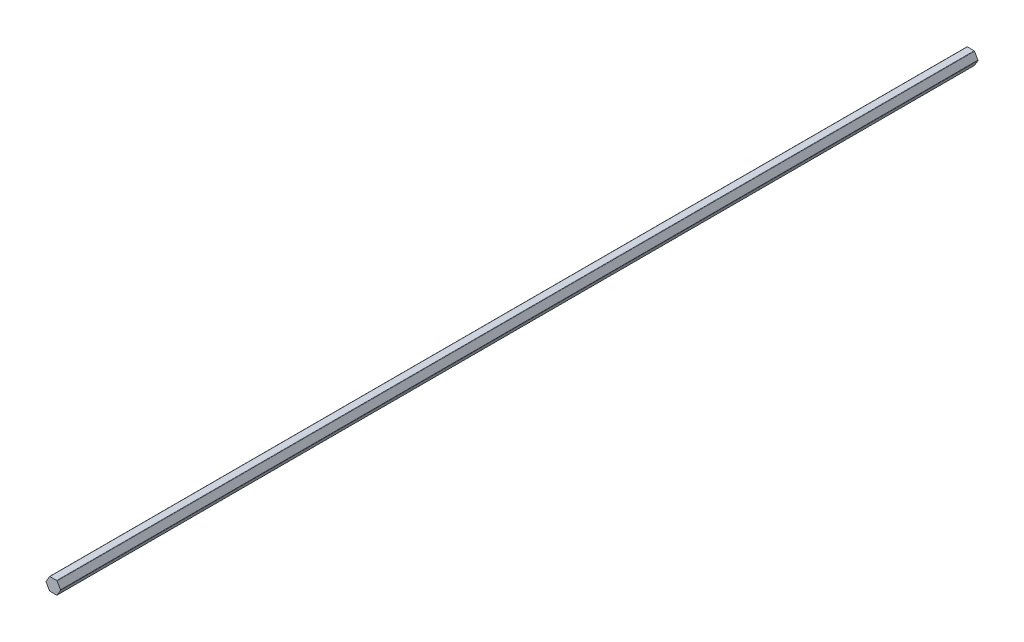
ISO-10303-21;
HEADER;
FILE_DESCRIPTION(('STEP AP214'),'2;1');
FILE_NAME('part.step','',(''),(''),'','','');
FILE_SCHEMA(('AUTOMOTIVE_DESIGN { 1 0 10303 214 1 1 1 1 }'));
ENDSEC;
DATA;
#1=APPLICATION_CONTEXT('core data for automotive mechanical design processes');
#2=APPLICATION_PROTOCOL_DEFINITION('international standard','automotive_design',2000,#1);
#3=PRODUCT_CONTEXT('',#1,'mechanical');
#4=PRODUCT('Part','Part','',(#3));
#5=PRODUCT_RELATED_PRODUCT_CATEGORY('part','',(#4));
#6=PRODUCT_DEFINITION_FORMATION('','',#4);
#7=PRODUCT_DEFINITION_CONTEXT('part definition',#1,'design');
#8=PRODUCT_DEFINITION('design','',#6,#7);
#9=PRODUCT_DEFINITION_SHAPE('','',#8);
#10=(LENGTH_UNIT() NAMED_UNIT(*) SI_UNIT(.MILLI.,.METRE.));
#11=(NAMED_UNIT(*) PLANE_ANGLE_UNIT() SI_UNIT($,.RADIAN.));
#12=(NAMED_UNIT(*) SI_UNIT($,.STERADIAN.) SOLID_ANGLE_UNIT());
#13=UNCERTAINTY_MEASURE_WITH_UNIT(LENGTH_MEASURE(1.E-05),#10,'distance_accuracy_value','');
#14=(GEOMETRIC_REPRESENTATION_CONTEXT(3) GLOBAL_UNCERTAINTY_ASSIGNED_CONTEXT((#13)) GLOBAL_UNIT_ASSIGNED_CONTEXT((#10,
#11,#12)) REPRESENTATION_CONTEXT('',''));
#15=CARTESIAN_POINT('',(0.,0.,0.));
#16=DIRECTION('',(0.,0.,1.));
#17=DIRECTION('',(1.,0.,0.));
#18=AXIS2_PLACEMENT_3D('',#15,#16,#17);
#19=CARTESIAN_POINT('',(3.66617420935413,-6.35,457.2));
#20=DIRECTION('',(-0.866025403784439,0.499999999999999,0.));
#21=DIRECTION('',(-0.499999999999999,-0.866025403784439,0.));
#22=AXIS2_PLACEMENT_3D('',#19,#20,#21);
#23=PLANE('',#22);
#24=DIRECTION('',(0.499999999999999,0.866025403784439,0.));
#25=VECTOR('',#24,1.);
#26=CARTESIAN_POINT('',(3.66617420935413,-6.35,457.2));
#27=LINE('',#26,#25);
#28=CARTESIAN_POINT('',(3.81282117772829,-6.096,457.2));
#29=VERTEX_POINT('',#28);
#30=CARTESIAN_POINT('',(7.18570145033408,-0.253999999999996,457.2));
#31=VERTEX_POINT('',#30);
#32=EDGE_CURVE('E151',#29,#31,#27,.T.);
#33=ORIENTED_EDGE('',*,*,#32,.F.);
#34=DIRECTION('',(0.,0.,-1.));
#35=VECTOR('',#34,1.);
#36=CARTESIAN_POINT('',(3.81282117772829,-6.096,457.2));
#37=LINE('',#36,#35);
#38=CARTESIAN_POINT('',(3.81282117772829,-6.096,-457.2));
#39=VERTEX_POINT('',#38);
#40=EDGE_CURVE('E189',#29,#39,#37,.T.);
#41=ORIENTED_EDGE('',*,*,#40,.T.);
#42=DIRECTION('',(0.499999999999999,0.866025403784439,0.));
#43=VECTOR('',#42,1.);
#44=CARTESIAN_POINT('',(3.66617420935413,-6.35,-457.2));
#45=LINE('',#44,#43);
#46=CARTESIAN_POINT('',(7.18570145033408,-0.253999999999996,-457.2));
#47=VERTEX_POINT('',#46);
#48=EDGE_CURVE('E213',#39,#47,#45,.T.);
#49=ORIENTED_EDGE('',*,*,#48,.T.);
#50=DIRECTION('',(0.,0.,-1.));
#51=VECTOR('',#50,1.);
#52=CARTESIAN_POINT('',(7.18570145033408,-0.253999999999996,457.2));
#53=LINE('',#52,#51);
#54=EDGE_CURVE('E187',#47,#31,#53,.F.);
#55=ORIENTED_EDGE('',*,*,#54,.T.);
#56=EDGE_LOOP('',(#33,#41,#49,#55));
#57=FACE_BOUND('',#56,.T.);
#58=ADVANCED_FACE('F34',(#57),#23,.F.);
#59=CARTESIAN_POINT('',(7.33234841870825,0.,457.2));
#60=DIRECTION('',(-0.866025403784439,-0.5,0.));
#61=DIRECTION('',(0.5,-0.866025403784438,0.));
#62=AXIS2_PLACEMENT_3D('',#59,#60,#61);
#63=PLANE('',#62);
#64=DIRECTION('',(-0.5,0.866025403784438,0.));
#65=VECTOR('',#64,1.);
#66=CARTESIAN_POINT('',(7.33234841870825,0.,457.2));
#67=LINE('',#66,#65);
#68=CARTESIAN_POINT('',(7.18570145033408,0.254000000000004,457.2));
#69=VERTEX_POINT('',#68);
#70=CARTESIAN_POINT('',(3.81282117772829,6.096,457.2));
#71=VERTEX_POINT('',#70);
#72=EDGE_CURVE('E155',#69,#71,#67,.T.);
#73=ORIENTED_EDGE('',*,*,#72,.F.);
#74=DIRECTION('',(0.,0.,-1.));
#75=VECTOR('',#74,1.);
#76=CARTESIAN_POINT('',(7.18570145033408,0.254000000000004,457.2));
#77=LINE('',#76,#75);
#78=CARTESIAN_POINT('',(7.18570145033408,0.254000000000004,-457.2));
#79=VERTEX_POINT('',#78);
#80=EDGE_CURVE('E194',#69,#79,#77,.T.);
#81=ORIENTED_EDGE('',*,*,#80,.T.);
#82=DIRECTION('',(-0.5,0.866025403784438,0.));
#83=VECTOR('',#82,1.);
#84=CARTESIAN_POINT('',(7.33234841870825,0.,-457.2));
#85=LINE('',#84,#83);
#86=CARTESIAN_POINT('',(3.81282117772829,6.096,-457.2));
#87=VERTEX_POINT('',#86);
#88=EDGE_CURVE('E211',#79,#87,#85,.T.);
#89=ORIENTED_EDGE('',*,*,#88,.T.);
#90=DIRECTION('',(0.,0.,-1.));
#91=VECTOR('',#90,1.);
#92=CARTESIAN_POINT('',(3.81282117772829,6.096,457.2));
#93=LINE('',#92,#91);
#94=EDGE_CURVE('E192',#87,#71,#93,.F.);
#95=ORIENTED_EDGE('',*,*,#94,.T.);
#96=EDGE_LOOP('',(#73,#81,#89,#95));
#97=FACE_BOUND('',#96,.T.);
#98=ADVANCED_FACE('F232',(#97),#63,.F.);
#99=CARTESIAN_POINT('',(3.66617420935412,6.35,457.2));
#100=DIRECTION('',(0.,-1.,0.));
#101=DIRECTION('',(1.,0.,0.));
#102=AXIS2_PLACEMENT_3D('',#99,#100,#101);
#103=PLANE('',#102);
#104=DIRECTION('',(-1.,0.,0.));
#105=VECTOR('',#104,1.);
#106=CARTESIAN_POINT('',(3.66617420935412,6.35,-457.2));
#107=LINE('',#106,#105);
#108=CARTESIAN_POINT('',(3.37288027260579,6.35,-457.2));
#109=VERTEX_POINT('',#108);
#110=CARTESIAN_POINT('',(-3.3728802726058,6.35,-457.2));
#111=VERTEX_POINT('',#110);
#112=EDGE_CURVE('E203',#109,#111,#107,.T.);
#113=ORIENTED_EDGE('',*,*,#112,.T.);
#114=DIRECTION('',(0.,0.,-1.));
#115=VECTOR('',#114,1.);
#116=CARTESIAN_POINT('',(-3.3728802726058,6.35,457.2));
#117=LINE('',#116,#115);
#118=CARTESIAN_POINT('',(-3.3728802726058,6.35,457.2));
#119=VERTEX_POINT('',#118);
#120=EDGE_CURVE('E11',#111,#119,#117,.F.);
#121=ORIENTED_EDGE('',*,*,#120,.T.);
#122=DIRECTION('',(-1.,0.,0.));
#123=VECTOR('',#122,1.);
#124=CARTESIAN_POINT('',(3.66617420935412,6.35,457.2));
#125=LINE('',#124,#123);
#126=CARTESIAN_POINT('',(3.37288027260579,6.35,457.2));
#127=VERTEX_POINT('',#126);
#128=EDGE_CURVE('E205',#127,#119,#125,.T.);
#129=ORIENTED_EDGE('',*,*,#128,.F.);
#130=DIRECTION('',(0.,0.,-1.));
#131=VECTOR('',#130,1.);
#132=CARTESIAN_POINT('',(3.37288027260579,6.35,457.2));
#133=LINE('',#132,#131);
#134=EDGE_CURVE('E42',#127,#109,#133,.T.);
#135=ORIENTED_EDGE('',*,*,#134,.T.);
#136=EDGE_LOOP('',(#113,#121,#129,#135));
#137=FACE_BOUND('',#136,.T.);
#138=ADVANCED_FACE('F202',(#137),#103,.F.);
#139=CARTESIAN_POINT('',(-3.66617420935412,6.35,457.2));
#140=DIRECTION('',(0.866025403784439,-0.499999999999999,0.));
#141=DIRECTION('',(0.5,0.866025403784439,0.));
#142=AXIS2_PLACEMENT_3D('',#139,#140,#141);
#143=PLANE('',#142);
#144=DIRECTION('',(-0.5,-0.866025403784439,0.));
#145=VECTOR('',#144,1.);
#146=CARTESIAN_POINT('',(-3.66617420935412,6.35,-457.2));
#147=LINE('',#146,#145);
#148=CARTESIAN_POINT('',(-3.81282117772829,6.096,-457.2));
#149=VERTEX_POINT('',#148);
#150=CARTESIAN_POINT('',(-7.18570145033408,0.253999999999998,-457.2));
#151=VERTEX_POINT('',#150);
#152=EDGE_CURVE('E157',#149,#151,#147,.T.);
#153=ORIENTED_EDGE('',*,*,#152,.T.);
#154=DIRECTION('',(0.,0.,-1.));
#155=VECTOR('',#154,1.);
#156=CARTESIAN_POINT('',(-7.18570145033408,0.253999999999998,457.2));
#157=LINE('',#156,#155);
#158=CARTESIAN_POINT('',(-7.18570145033408,0.253999999999998,457.2));
#159=VERTEX_POINT('',#158);
#160=EDGE_CURVE('E49',#151,#159,#157,.F.);
#161=ORIENTED_EDGE('',*,*,#160,.T.);
#162=DIRECTION('',(-0.5,-0.866025403784439,0.));
#163=VECTOR('',#162,1.);
#164=CARTESIAN_POINT('',(-3.66617420935412,6.35,457.2));
#165=LINE('',#164,#163);
#166=CARTESIAN_POINT('',(-3.81282117772829,6.096,457.2));
#167=VERTEX_POINT('',#166);
#168=EDGE_CURVE('E222',#167,#159,#165,.T.);
#169=ORIENTED_EDGE('',*,*,#168,.F.);
#170=DIRECTION('',(0.,0.,-1.));
#171=VECTOR('',#170,1.);
#172=CARTESIAN_POINT('',(-3.81282117772829,6.096,457.2));
#173=LINE('',#172,#171);
#174=EDGE_CURVE('E183',#167,#149,#173,.T.);
#175=ORIENTED_EDGE('',*,*,#174,.T.);
#176=EDGE_LOOP('',(#153,#161,#169,#175));
#177=FACE_BOUND('',#176,.T.);
#178=ADVANCED_FACE('F270',(#177),#143,.F.);
#179=CARTESIAN_POINT('',(-7.33234841870824,0.,457.2));
#180=DIRECTION('',(0.866025403784438,0.5,0.));
#181=DIRECTION('',(-0.5,0.866025403784439,0.));
#182=AXIS2_PLACEMENT_3D('',#179,#180,#181);
#183=PLANE('',#182);
#184=DIRECTION('',(0.5,-0.866025403784438,0.));
#185=VECTOR('',#184,1.);
#186=CARTESIAN_POINT('',(-7.33234841870824,0.,-457.2));
#187=LINE('',#186,#185);
#188=CARTESIAN_POINT('',(-7.18570145033408,-0.254000000000001,-457.2));
#189=VERTEX_POINT('',#188);
#190=CARTESIAN_POINT('',(-3.81282117772828,-6.096,-457.2));
#191=VERTEX_POINT('',#190);
#192=EDGE_CURVE('E152',#189,#191,#187,.T.);
#193=ORIENTED_EDGE('',*,*,#192,.T.);
#194=DIRECTION('',(0.,0.,-1.));
#195=VECTOR('',#194,1.);
#196=CARTESIAN_POINT('',(-3.81282117772828,-6.096,457.2));
#197=LINE('',#196,#195);
#198=CARTESIAN_POINT('',(-3.81282117772828,-6.096,457.2));
#199=VERTEX_POINT('',#198);
#200=EDGE_CURVE('E129',#191,#199,#197,.F.);
#201=ORIENTED_EDGE('',*,*,#200,.T.);
#202=DIRECTION('',(0.5,-0.866025403784438,0.));
#203=VECTOR('',#202,1.);
#204=CARTESIAN_POINT('',(-7.33234841870824,0.,457.2));
#205=LINE('',#204,#203);
#206=CARTESIAN_POINT('',(-7.18570145033408,-0.254000000000001,457.2));
#207=VERTEX_POINT('',#206);
#208=EDGE_CURVE('E219',#207,#199,#205,.T.);
#209=ORIENTED_EDGE('',*,*,#208,.F.);
#210=DIRECTION('',(0.,0.,-1.));
#211=VECTOR('',#210,1.);
#212=CARTESIAN_POINT('',(-7.18570145033408,-0.254000000000001,457.2));
#213=LINE('',#212,#211);
#214=EDGE_CURVE('E134',#207,#189,#213,.T.);
#215=ORIENTED_EDGE('',*,*,#214,.T.);
#216=EDGE_LOOP('',(#193,#201,#209,#215));
#217=FACE_BOUND('',#216,.T.);
#218=ADVANCED_FACE('F269',(#217),#183,.F.);
#219=CARTESIAN_POINT('',(-3.66617420935412,-6.35,457.2));
#220=DIRECTION('',(0.,1.,0.));
#221=DIRECTION('',(-1.,0.,0.));
#222=AXIS2_PLACEMENT_3D('',#219,#220,#221);
#223=PLANE('',#222);
#224=DIRECTION('',(1.,0.,0.));
#225=VECTOR('',#224,1.);
#226=CARTESIAN_POINT('',(-3.66617420935412,-6.35,457.2));
#227=LINE('',#226,#225);
#228=CARTESIAN_POINT('',(-3.37288027260579,-6.35,457.2));
#229=VERTEX_POINT('',#228);
#230=CARTESIAN_POINT('',(3.3728802726058,-6.35,457.2));
#231=VERTEX_POINT('',#230);
#232=EDGE_CURVE('E144',#229,#231,#227,.T.);
#233=ORIENTED_EDGE('',*,*,#232,.F.);
#234=DIRECTION('',(0.,0.,-1.));
#235=VECTOR('',#234,1.);
#236=CARTESIAN_POINT('',(-3.37288027260579,-6.35,457.2));
#237=LINE('',#236,#235);
#238=CARTESIAN_POINT('',(-3.37288027260579,-6.35,-457.2));
#239=VERTEX_POINT('',#238);
#240=EDGE_CURVE('E128',#229,#239,#237,.T.);
#241=ORIENTED_EDGE('',*,*,#240,.T.);
#242=DIRECTION('',(1.,0.,0.));
#243=VECTOR('',#242,1.);
#244=CARTESIAN_POINT('',(-3.66617420935412,-6.35,-457.2));
#245=LINE('',#244,#243);
#246=CARTESIAN_POINT('',(3.3728802726058,-6.35,-457.2));
#247=VERTEX_POINT('',#246);
#248=EDGE_CURVE('E141',#239,#247,#245,.T.);
#249=ORIENTED_EDGE('',*,*,#248,.T.);
#250=DIRECTION('',(0.,0.,-1.));
#251=VECTOR('',#250,1.);
#252=CARTESIAN_POINT('',(3.3728802726058,-6.35,457.2));
#253=LINE('',#252,#251);
#254=EDGE_CURVE('E146',#247,#231,#253,.F.);
#255=ORIENTED_EDGE('',*,*,#254,.T.);
#256=EDGE_LOOP('',(#233,#241,#249,#255));
#257=FACE_BOUND('',#256,.T.);
#258=ADVANCED_FACE('F140',(#257),#223,.F.);
#259=CARTESIAN_POINT('',(7.33234841870825,0.,457.2));
#260=DIRECTION('',(0.,0.,1.));
#261=DIRECTION('',(1.,0.,0.));
#262=AXIS2_PLACEMENT_3D('',#259,#260,#261);
#263=PLANE('',#262);
#264=ORIENTED_EDGE('',*,*,#208,.T.);
#265=CARTESIAN_POINT('',(-3.37288027260579,-5.842,457.2));
#266=DIRECTION('',(0.,0.,1.));
#267=DIRECTION('',(1.,0.,0.));
#268=AXIS2_PLACEMENT_3D('',#265,#266,#267);
#269=CIRCLE('',#268,0.508);
#270=EDGE_CURVE('E181',#199,#229,#269,.T.);
#271=ORIENTED_EDGE('',*,*,#270,.T.);
#272=ORIENTED_EDGE('',*,*,#232,.T.);
#273=CARTESIAN_POINT('',(3.3728802726058,-5.842,457.2));
#274=DIRECTION('',(0.,0.,1.));
#275=DIRECTION('',(1.,0.,0.));
#276=AXIS2_PLACEMENT_3D('',#273,#274,#275);
#277=CIRCLE('',#276,0.508);
#278=EDGE_CURVE('E177',#231,#29,#277,.T.);
#279=ORIENTED_EDGE('',*,*,#278,.T.);
#280=ORIENTED_EDGE('',*,*,#32,.T.);
#281=CARTESIAN_POINT('',(6.74576054521159,0.,457.2));
#282=DIRECTION('',(0.,0.,1.));
#283=DIRECTION('',(1.,0.,0.));
#284=AXIS2_PLACEMENT_3D('',#281,#282,#283);
#285=CIRCLE('',#284,0.508);
#286=EDGE_CURVE('E175',#31,#69,#285,.T.);
#287=ORIENTED_EDGE('',*,*,#286,.T.);
#288=ORIENTED_EDGE('',*,*,#72,.T.);
#289=CARTESIAN_POINT('',(3.37288027260579,5.842,457.2));
#290=DIRECTION('',(0.,0.,1.));
#291=DIRECTION('',(1.,0.,0.));
#292=AXIS2_PLACEMENT_3D('',#289,#290,#291);
#293=CIRCLE('',#292,0.508);
#294=EDGE_CURVE('E172',#71,#127,#293,.T.);
#295=ORIENTED_EDGE('',*,*,#294,.T.);
#296=ORIENTED_EDGE('',*,*,#128,.T.);
#297=CARTESIAN_POINT('',(-3.37288027260579,5.842,457.2));
#298=DIRECTION('',(0.,0.,1.));
#299=DIRECTION('',(1.,0.,0.));
#300=AXIS2_PLACEMENT_3D('',#297,#298,#299);
#301=CIRCLE('',#300,0.508);
#302=EDGE_CURVE('E56',#119,#167,#301,.T.);
#303=ORIENTED_EDGE('',*,*,#302,.T.);
#304=ORIENTED_EDGE('',*,*,#168,.T.);
#305=CARTESIAN_POINT('',(-6.74576054521159,0.,457.2));
#306=DIRECTION('',(0.,0.,1.));
#307=DIRECTION('',(1.,0.,0.));
#308=AXIS2_PLACEMENT_3D('',#305,#306,#307);
#309=CIRCLE('',#308,0.508);
#310=EDGE_CURVE('E179',#159,#207,#309,.T.);
#311=ORIENTED_EDGE('',*,*,#310,.T.);
#312=EDGE_LOOP('',(#264,#271,#272,#279,#280,#287,#288,#295,#296,#303,#304,#311));
#313=FACE_BOUND('',#312,.T.);
#314=ADVANCED_FACE('F227',(#313),#263,.T.);
#315=CARTESIAN_POINT('',(7.33234841870825,0.,-457.2));
#316=DIRECTION('',(0.,0.,1.));
#317=DIRECTION('',(1.,0.,0.));
#318=AXIS2_PLACEMENT_3D('',#315,#316,#317);
#319=PLANE('',#318);
#320=ORIENTED_EDGE('',*,*,#248,.F.);
#321=CARTESIAN_POINT('',(-3.37288027260579,-5.842,-457.2));
#322=DIRECTION('',(0.,0.,1.));
#323=DIRECTION('',(1.,0.,0.));
#324=AXIS2_PLACEMENT_3D('',#321,#322,#323);
#325=CIRCLE('',#324,0.508);
#326=EDGE_CURVE('E124',#239,#191,#325,.F.);
#327=ORIENTED_EDGE('',*,*,#326,.T.);
#328=ORIENTED_EDGE('',*,*,#192,.F.);
#329=CARTESIAN_POINT('',(-6.74576054521159,0.,-457.2));
#330=DIRECTION('',(0.,0.,1.));
#331=DIRECTION('',(1.,0.,0.));
#332=AXIS2_PLACEMENT_3D('',#329,#330,#331);
#333=CIRCLE('',#332,0.508);
#334=EDGE_CURVE('E135',#189,#151,#333,.F.);
#335=ORIENTED_EDGE('',*,*,#334,.T.);
#336=ORIENTED_EDGE('',*,*,#152,.F.);
#337=CARTESIAN_POINT('',(-3.37288027260579,5.842,-457.2));
#338=DIRECTION('',(0.,0.,1.));
#339=DIRECTION('',(1.,0.,0.));
#340=AXIS2_PLACEMENT_3D('',#337,#338,#339);
#341=CIRCLE('',#340,0.508);
#342=EDGE_CURVE('E163',#149,#111,#341,.F.);
#343=ORIENTED_EDGE('',*,*,#342,.T.);
#344=ORIENTED_EDGE('',*,*,#112,.F.);
#345=CARTESIAN_POINT('',(3.37288027260579,5.842,-457.2));
#346=DIRECTION('',(0.,0.,1.));
#347=DIRECTION('',(1.,0.,0.));
#348=AXIS2_PLACEMENT_3D('',#345,#346,#347);
#349=CIRCLE('',#348,0.508);
#350=EDGE_CURVE('E145',#109,#87,#349,.F.);
#351=ORIENTED_EDGE('',*,*,#350,.T.);
#352=ORIENTED_EDGE('',*,*,#88,.F.);
#353=CARTESIAN_POINT('',(6.74576054521159,0.,-457.2));
#354=DIRECTION('',(0.,0.,1.));
#355=DIRECTION('',(1.,0.,0.));
#356=AXIS2_PLACEMENT_3D('',#353,#354,#355);
#357=CIRCLE('',#356,0.508);
#358=EDGE_CURVE('E165',#79,#47,#357,.F.);
#359=ORIENTED_EDGE('',*,*,#358,.T.);
#360=ORIENTED_EDGE('',*,*,#48,.F.);
#361=CARTESIAN_POINT('',(3.3728802726058,-5.842,-457.2));
#362=DIRECTION('',(0.,0.,1.));
#363=DIRECTION('',(1.,0.,0.));
#364=AXIS2_PLACEMENT_3D('',#361,#362,#363);
#365=CIRCLE('',#364,0.508);
#366=EDGE_CURVE('E150',#39,#247,#365,.F.);
#367=ORIENTED_EDGE('',*,*,#366,.T.);
#368=EDGE_LOOP('',(#320,#327,#328,#335,#336,#343,#344,#351,#352,#359,#360,#367));
#369=FACE_BOUND('',#368,.T.);
#370=ADVANCED_FACE('F148',(#369),#319,.F.);
#371=CARTESIAN_POINT('',(-3.37288027260579,-5.842,457.2));
#372=DIRECTION('',(0.,0.,-1.));
#373=DIRECTION('',(-1.,0.,0.));
#374=AXIS2_PLACEMENT_3D('',#371,#372,#373);
#375=CYLINDRICAL_SURFACE('',#374,0.508);
#376=ORIENTED_EDGE('',*,*,#270,.F.);
#377=ORIENTED_EDGE('',*,*,#200,.F.);
#378=ORIENTED_EDGE('',*,*,#326,.F.);
#379=ORIENTED_EDGE('',*,*,#240,.F.);
#380=EDGE_LOOP('',(#376,#377,#378,#379));
#381=FACE_BOUND('',#380,.T.);
#382=ADVANCED_FACE('F127',(#381),#375,.T.);
#383=CARTESIAN_POINT('',(-6.74576054521159,0.,457.2));
#384=DIRECTION('',(0.,0.,-1.));
#385=DIRECTION('',(-1.,0.,0.));
#386=AXIS2_PLACEMENT_3D('',#383,#384,#385);
#387=CYLINDRICAL_SURFACE('',#386,0.508);
#388=ORIENTED_EDGE('',*,*,#310,.F.);
#389=ORIENTED_EDGE('',*,*,#160,.F.);
#390=ORIENTED_EDGE('',*,*,#334,.F.);
#391=ORIENTED_EDGE('',*,*,#214,.F.);
#392=EDGE_LOOP('',(#388,#389,#390,#391));
#393=FACE_BOUND('',#392,.T.);
#394=ADVANCED_FACE('F248',(#393),#387,.T.);
#395=CARTESIAN_POINT('',(3.3728802726058,-5.842,457.2));
#396=DIRECTION('',(0.,0.,-1.));
#397=DIRECTION('',(-1.,0.,0.));
#398=AXIS2_PLACEMENT_3D('',#395,#396,#397);
#399=CYLINDRICAL_SURFACE('',#398,0.508);
#400=ORIENTED_EDGE('',*,*,#278,.F.);
#401=ORIENTED_EDGE('',*,*,#254,.F.);
#402=ORIENTED_EDGE('',*,*,#366,.F.);
#403=ORIENTED_EDGE('',*,*,#40,.F.);
#404=EDGE_LOOP('',(#400,#401,#402,#403));
#405=FACE_BOUND('',#404,.T.);
#406=ADVANCED_FACE('F241',(#405),#399,.T.);
#407=CARTESIAN_POINT('',(6.74576054521159,0.,457.2));
#408=DIRECTION('',(0.,0.,-1.));
#409=DIRECTION('',(-1.,0.,0.));
#410=AXIS2_PLACEMENT_3D('',#407,#408,#409);
#411=CYLINDRICAL_SURFACE('',#410,0.508);
#412=ORIENTED_EDGE('',*,*,#286,.F.);
#413=ORIENTED_EDGE('',*,*,#54,.F.);
#414=ORIENTED_EDGE('',*,*,#358,.F.);
#415=ORIENTED_EDGE('',*,*,#80,.F.);
#416=EDGE_LOOP('',(#412,#413,#414,#415));
#417=FACE_BOUND('',#416,.T.);
#418=ADVANCED_FACE('F238',(#417),#411,.T.);
#419=CARTESIAN_POINT('',(-3.37288027260579,5.842,457.2));
#420=DIRECTION('',(0.,0.,-1.));
#421=DIRECTION('',(-1.,0.,0.));
#422=AXIS2_PLACEMENT_3D('',#419,#420,#421);
#423=CYLINDRICAL_SURFACE('',#422,0.508);
#424=ORIENTED_EDGE('',*,*,#302,.F.);
#425=ORIENTED_EDGE('',*,*,#120,.F.);
#426=ORIENTED_EDGE('',*,*,#342,.F.);
#427=ORIENTED_EDGE('',*,*,#174,.F.);
#428=EDGE_LOOP('',(#424,#425,#426,#427));
#429=FACE_BOUND('',#428,.T.);
#430=ADVANCED_FACE('F240',(#429),#423,.T.);
#431=CARTESIAN_POINT('',(3.37288027260579,5.842,457.2));
#432=DIRECTION('',(0.,0.,-1.));
#433=DIRECTION('',(-1.,0.,0.));
#434=AXIS2_PLACEMENT_3D('',#431,#432,#433);
#435=CYLINDRICAL_SURFACE('',#434,0.508);
#436=ORIENTED_EDGE('',*,*,#294,.F.);
#437=ORIENTED_EDGE('',*,*,#94,.F.);
#438=ORIENTED_EDGE('',*,*,#350,.F.);
#439=ORIENTED_EDGE('',*,*,#134,.F.);
#440=EDGE_LOOP('',(#436,#437,#438,#439));
#441=FACE_BOUND('',#440,.T.);
#442=ADVANCED_FACE('F36',(#441),#435,.T.);
#443=CLOSED_SHELL('',(#58,#98,#138,#178,#218,#258,#314,#370,#382,#394,#406,#418,#430,#442));
#444=MANIFOLD_SOLID_BREP('B2',#443);
#445=ADVANCED_BREP_SHAPE_REPRESENTATION('',(#18,#444),#14);
#446=SHAPE_DEFINITION_REPRESENTATION(#9,#445);
ENDSEC;
END-ISO-10303-21;
